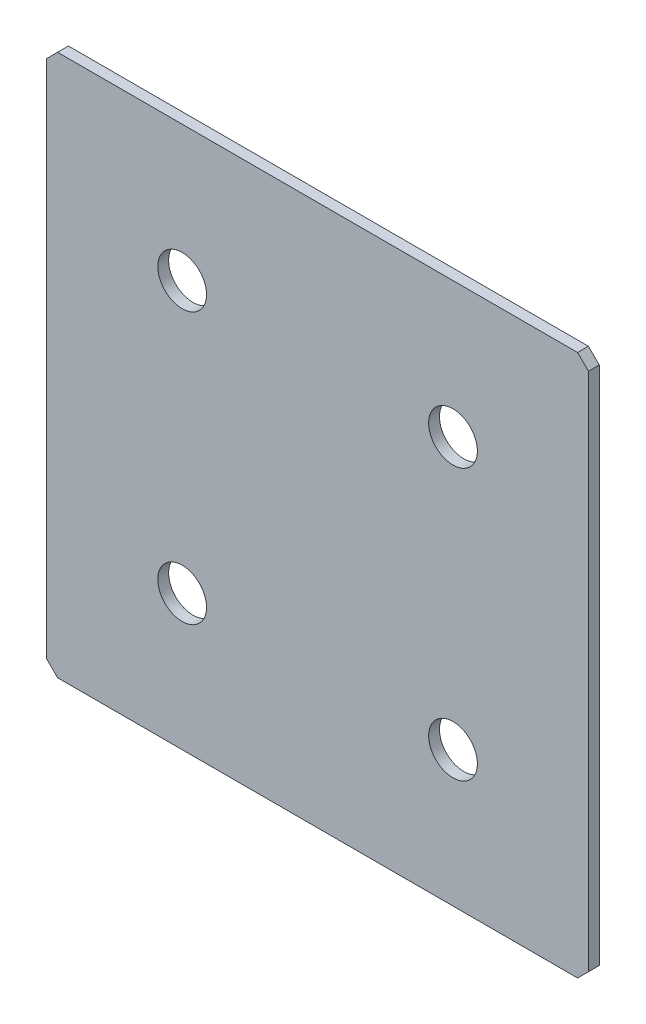
ISO-10303-21;
HEADER;
FILE_DESCRIPTION(('STEP AP214'),'2;1');
FILE_NAME('part.step','',(''),(''),'','','');
FILE_SCHEMA(('AUTOMOTIVE_DESIGN { 1 0 10303 214 1 1 1 1 }'));
ENDSEC;
DATA;
#1=APPLICATION_CONTEXT('core data for automotive mechanical design processes');
#2=APPLICATION_PROTOCOL_DEFINITION('international standard','automotive_design',2000,#1);
#3=PRODUCT_CONTEXT('',#1,'mechanical');
#4=PRODUCT('Part','Part','',(#3));
#5=PRODUCT_RELATED_PRODUCT_CATEGORY('part','',(#4));
#6=PRODUCT_DEFINITION_FORMATION('','',#4);
#7=PRODUCT_DEFINITION_CONTEXT('part definition',#1,'design');
#8=PRODUCT_DEFINITION('design','',#6,#7);
#9=PRODUCT_DEFINITION_SHAPE('','',#8);
#10=(LENGTH_UNIT() NAMED_UNIT(*) SI_UNIT(.MILLI.,.METRE.));
#11=(NAMED_UNIT(*) PLANE_ANGLE_UNIT() SI_UNIT($,.RADIAN.));
#12=(NAMED_UNIT(*) SI_UNIT($,.STERADIAN.) SOLID_ANGLE_UNIT());
#13=UNCERTAINTY_MEASURE_WITH_UNIT(LENGTH_MEASURE(1.E-05),#10,'distance_accuracy_value','');
#14=(GEOMETRIC_REPRESENTATION_CONTEXT(3) GLOBAL_UNCERTAINTY_ASSIGNED_CONTEXT((#13)) GLOBAL_UNIT_ASSIGNED_CONTEXT((#10,
#11,#12)) REPRESENTATION_CONTEXT('',''));
#15=CARTESIAN_POINT('',(0.,0.,0.));
#16=DIRECTION('',(0.,0.,1.));
#17=DIRECTION('',(1.,0.,0.));
#18=AXIS2_PLACEMENT_3D('',#15,#16,#17);
#19=CARTESIAN_POINT('',(50.,-50.,2.));
#20=DIRECTION('',(-1.,0.,0.));
#21=DIRECTION('',(0.,0.,1.));
#22=AXIS2_PLACEMENT_3D('',#19,#20,#21);
#23=PLANE('',#22);
#24=DIRECTION('',(0.,1.,0.));
#25=VECTOR('',#24,1.);
#26=CARTESIAN_POINT('',(50.,-50.,2.));
#27=LINE('',#26,#25);
#28=CARTESIAN_POINT('',(50.,-48.,2.));
#29=VERTEX_POINT('',#28);
#30=CARTESIAN_POINT('',(50.,48.,2.));
#31=VERTEX_POINT('',#30);
#32=EDGE_CURVE('E128',#29,#31,#27,.T.);
#33=ORIENTED_EDGE('',*,*,#32,.F.);
#34=DIRECTION('',(0.,0.,-1.));
#35=VECTOR('',#34,1.);
#36=CARTESIAN_POINT('',(50.,-48.,2.));
#37=LINE('',#36,#35);
#38=CARTESIAN_POINT('',(50.,-48.,0.));
#39=VERTEX_POINT('',#38);
#40=EDGE_CURVE('E154',#29,#39,#37,.T.);
#41=ORIENTED_EDGE('',*,*,#40,.T.);
#42=DIRECTION('',(0.,1.,0.));
#43=VECTOR('',#42,1.);
#44=CARTESIAN_POINT('',(50.,-50.,0.));
#45=LINE('',#44,#43);
#46=CARTESIAN_POINT('',(50.,48.,0.));
#47=VERTEX_POINT('',#46);
#48=EDGE_CURVE('E162',#39,#47,#45,.T.);
#49=ORIENTED_EDGE('',*,*,#48,.T.);
#50=DIRECTION('',(0.,0.,1.));
#51=VECTOR('',#50,1.);
#52=CARTESIAN_POINT('',(50.,48.,2.));
#53=LINE('',#52,#51);
#54=EDGE_CURVE('E152',#47,#31,#53,.T.);
#55=ORIENTED_EDGE('',*,*,#54,.T.);
#56=EDGE_LOOP('',(#33,#41,#49,#55));
#57=FACE_BOUND('',#56,.T.);
#58=ADVANCED_FACE('F37',(#57),#23,.F.);
#59=CARTESIAN_POINT('',(-50.,50.,2.));
#60=DIRECTION('',(0.,-1.,0.));
#61=DIRECTION('',(0.,0.,-1.));
#62=AXIS2_PLACEMENT_3D('',#59,#60,#61);
#63=PLANE('',#62);
#64=DIRECTION('',(-1.,0.,0.));
#65=VECTOR('',#64,1.);
#66=CARTESIAN_POINT('',(-50.,50.,0.));
#67=LINE('',#66,#65);
#68=CARTESIAN_POINT('',(48.,50.,0.));
#69=VERTEX_POINT('',#68);
#70=CARTESIAN_POINT('',(-48.,50.,0.));
#71=VERTEX_POINT('',#70);
#72=EDGE_CURVE('E133',#69,#71,#67,.T.);
#73=ORIENTED_EDGE('',*,*,#72,.T.);
#74=DIRECTION('',(0.,0.,1.));
#75=VECTOR('',#74,1.);
#76=CARTESIAN_POINT('',(-48.,50.,2.));
#77=LINE('',#76,#75);
#78=CARTESIAN_POINT('',(-48.,50.,2.));
#79=VERTEX_POINT('',#78);
#80=EDGE_CURVE('E11',#71,#79,#77,.T.);
#81=ORIENTED_EDGE('',*,*,#80,.T.);
#82=DIRECTION('',(-1.,0.,0.));
#83=VECTOR('',#82,1.);
#84=CARTESIAN_POINT('',(-50.,50.,2.));
#85=LINE('',#84,#83);
#86=CARTESIAN_POINT('',(48.,50.,2.));
#87=VERTEX_POINT('',#86);
#88=EDGE_CURVE('E131',#87,#79,#85,.T.);
#89=ORIENTED_EDGE('',*,*,#88,.F.);
#90=DIRECTION('',(0.,0.,-1.));
#91=VECTOR('',#90,1.);
#92=CARTESIAN_POINT('',(48.,50.,2.));
#93=LINE('',#92,#91);
#94=EDGE_CURVE('E45',#87,#69,#93,.T.);
#95=ORIENTED_EDGE('',*,*,#94,.T.);
#96=EDGE_LOOP('',(#73,#81,#89,#95));
#97=FACE_BOUND('',#96,.T.);
#98=ADVANCED_FACE('F159',(#97),#63,.F.);
#99=CARTESIAN_POINT('',(-50.,-50.,2.));
#100=DIRECTION('',(1.,0.,0.));
#101=DIRECTION('',(0.,0.,-1.));
#102=AXIS2_PLACEMENT_3D('',#99,#100,#101);
#103=PLANE('',#102);
#104=DIRECTION('',(0.,-1.,0.));
#105=VECTOR('',#104,1.);
#106=CARTESIAN_POINT('',(-50.,-50.,0.));
#107=LINE('',#106,#105);
#108=CARTESIAN_POINT('',(-50.,48.,0.));
#109=VERTEX_POINT('',#108);
#110=CARTESIAN_POINT('',(-50.,-48.,0.));
#111=VERTEX_POINT('',#110);
#112=EDGE_CURVE('E129',#109,#111,#107,.T.);
#113=ORIENTED_EDGE('',*,*,#112,.T.);
#114=DIRECTION('',(0.,0.,1.));
#115=VECTOR('',#114,1.);
#116=CARTESIAN_POINT('',(-50.,-48.,2.));
#117=LINE('',#116,#115);
#118=CARTESIAN_POINT('',(-50.,-48.,2.));
#119=VERTEX_POINT('',#118);
#120=EDGE_CURVE('E107',#111,#119,#117,.T.);
#121=ORIENTED_EDGE('',*,*,#120,.T.);
#122=DIRECTION('',(0.,-1.,0.));
#123=VECTOR('',#122,1.);
#124=CARTESIAN_POINT('',(-50.,-50.,2.));
#125=LINE('',#124,#123);
#126=CARTESIAN_POINT('',(-50.,48.,2.));
#127=VERTEX_POINT('',#126);
#128=EDGE_CURVE('E167',#127,#119,#125,.T.);
#129=ORIENTED_EDGE('',*,*,#128,.F.);
#130=DIRECTION('',(0.,0.,-1.));
#131=VECTOR('',#130,1.);
#132=CARTESIAN_POINT('',(-50.,48.,2.));
#133=LINE('',#132,#131);
#134=EDGE_CURVE('E112',#127,#109,#133,.T.);
#135=ORIENTED_EDGE('',*,*,#134,.T.);
#136=EDGE_LOOP('',(#113,#121,#129,#135));
#137=FACE_BOUND('',#136,.T.);
#138=ADVANCED_FACE('F210',(#137),#103,.F.);
#139=CARTESIAN_POINT('',(-50.,-50.,2.));
#140=DIRECTION('',(0.,1.,0.));
#141=DIRECTION('',(0.,0.,1.));
#142=AXIS2_PLACEMENT_3D('',#139,#140,#141);
#143=PLANE('',#142);
#144=DIRECTION('',(1.,0.,0.));
#145=VECTOR('',#144,1.);
#146=CARTESIAN_POINT('',(-50.,-50.,2.));
#147=LINE('',#146,#145);
#148=CARTESIAN_POINT('',(-48.,-50.,2.));
#149=VERTEX_POINT('',#148);
#150=CARTESIAN_POINT('',(48.,-50.,2.));
#151=VERTEX_POINT('',#150);
#152=EDGE_CURVE('E122',#149,#151,#147,.T.);
#153=ORIENTED_EDGE('',*,*,#152,.F.);
#154=DIRECTION('',(0.,0.,-1.));
#155=VECTOR('',#154,1.);
#156=CARTESIAN_POINT('',(-48.,-50.,2.));
#157=LINE('',#156,#155);
#158=CARTESIAN_POINT('',(-48.,-50.,0.));
#159=VERTEX_POINT('',#158);
#160=EDGE_CURVE('E106',#149,#159,#157,.T.);
#161=ORIENTED_EDGE('',*,*,#160,.T.);
#162=DIRECTION('',(1.,0.,0.));
#163=VECTOR('',#162,1.);
#164=CARTESIAN_POINT('',(-50.,-50.,0.));
#165=LINE('',#164,#163);
#166=CARTESIAN_POINT('',(48.,-50.,0.));
#167=VERTEX_POINT('',#166);
#168=EDGE_CURVE('E119',#159,#167,#165,.T.);
#169=ORIENTED_EDGE('',*,*,#168,.T.);
#170=DIRECTION('',(0.,0.,1.));
#171=VECTOR('',#170,1.);
#172=CARTESIAN_POINT('',(48.,-50.,2.));
#173=LINE('',#172,#171);
#174=EDGE_CURVE('E124',#167,#151,#173,.T.);
#175=ORIENTED_EDGE('',*,*,#174,.T.);
#176=EDGE_LOOP('',(#153,#161,#169,#175));
#177=FACE_BOUND('',#176,.T.);
#178=ADVANCED_FACE('F118',(#177),#143,.F.);
#179=CARTESIAN_POINT('',(0.,0.,2.));
#180=DIRECTION('',(0.,0.,-1.));
#181=DIRECTION('',(-1.,0.,0.));
#182=AXIS2_PLACEMENT_3D('',#179,#180,#181);
#183=PLANE('',#182);
#184=CARTESIAN_POINT('',(-25.,25.,2.));
#185=DIRECTION('',(0.,0.,1.));
#186=DIRECTION('',(1.,0.,0.));
#187=AXIS2_PLACEMENT_3D('',#184,#185,#186);
#188=CIRCLE('',#187,4.5);
#189=CARTESIAN_POINT('',(-20.5,25.,2.));
#190=VERTEX_POINT('',#189);
#191=EDGE_CURVE('E191',#190,#190,#188,.T.);
#192=ORIENTED_EDGE('',*,*,#191,.F.);
#193=EDGE_LOOP('',(#192));
#194=FACE_BOUND('',#193,.T.);
#195=CARTESIAN_POINT('',(25.,25.,2.));
#196=DIRECTION('',(0.,0.,1.));
#197=DIRECTION('',(1.,0.,0.));
#198=AXIS2_PLACEMENT_3D('',#195,#196,#197);
#199=CIRCLE('',#198,4.5);
#200=CARTESIAN_POINT('',(29.5,25.,2.));
#201=VERTEX_POINT('',#200);
#202=EDGE_CURVE('E185',#201,#201,#199,.T.);
#203=ORIENTED_EDGE('',*,*,#202,.F.);
#204=EDGE_LOOP('',(#203));
#205=FACE_BOUND('',#204,.T.);
#206=CARTESIAN_POINT('',(-25.,-25.,2.));
#207=DIRECTION('',(0.,0.,1.));
#208=DIRECTION('',(1.,0.,0.));
#209=AXIS2_PLACEMENT_3D('',#206,#207,#208);
#210=CIRCLE('',#209,4.5);
#211=CARTESIAN_POINT('',(-20.5,-25.,2.));
#212=VERTEX_POINT('',#211);
#213=EDGE_CURVE('E179',#212,#212,#210,.T.);
#214=ORIENTED_EDGE('',*,*,#213,.F.);
#215=EDGE_LOOP('',(#214));
#216=FACE_BOUND('',#215,.T.);
#217=CARTESIAN_POINT('',(25.,-25.,2.));
#218=DIRECTION('',(0.,0.,1.));
#219=DIRECTION('',(1.,0.,0.));
#220=AXIS2_PLACEMENT_3D('',#217,#218,#219);
#221=CIRCLE('',#220,4.5);
#222=CARTESIAN_POINT('',(29.5,-25.,2.));
#223=VERTEX_POINT('',#222);
#224=EDGE_CURVE('E173',#223,#223,#221,.T.);
#225=ORIENTED_EDGE('',*,*,#224,.F.);
#226=EDGE_LOOP('',(#225));
#227=FACE_BOUND('',#226,.T.);
#228=ORIENTED_EDGE('',*,*,#128,.T.);
#229=DIRECTION('',(-0.707106781186545,0.70710678118655,0.));
#230=VECTOR('',#229,1.);
#231=CARTESIAN_POINT('',(-48.,-50.,2.));
#232=LINE('',#231,#230);
#233=EDGE_CURVE('E150',#119,#149,#232,.F.);
#234=ORIENTED_EDGE('',*,*,#233,.T.);
#235=ORIENTED_EDGE('',*,*,#152,.T.);
#236=DIRECTION('',(-0.70710678118655,-0.707106781186545,0.));
#237=VECTOR('',#236,1.);
#238=CARTESIAN_POINT('',(50.,-48.,2.));
#239=LINE('',#238,#237);
#240=EDGE_CURVE('E148',#151,#29,#239,.F.);
#241=ORIENTED_EDGE('',*,*,#240,.T.);
#242=ORIENTED_EDGE('',*,*,#32,.T.);
#243=DIRECTION('',(0.707106781186545,-0.70710678118655,0.));
#244=VECTOR('',#243,1.);
#245=CARTESIAN_POINT('',(48.,50.,2.));
#246=LINE('',#245,#244);
#247=EDGE_CURVE('E57',#31,#87,#246,.F.);
#248=ORIENTED_EDGE('',*,*,#247,.T.);
#249=ORIENTED_EDGE('',*,*,#88,.T.);
#250=DIRECTION('',(0.70710678118655,0.707106781186545,0.));
#251=VECTOR('',#250,1.);
#252=CARTESIAN_POINT('',(-50.,48.,2.));
#253=LINE('',#252,#251);
#254=EDGE_CURVE('E146',#79,#127,#253,.F.);
#255=ORIENTED_EDGE('',*,*,#254,.T.);
#256=EDGE_LOOP('',(#228,#234,#235,#241,#242,#248,#249,#255));
#257=FACE_BOUND('',#256,.T.);
#258=ADVANCED_FACE('F197',(#194,#205,#216,#227,#257),#183,.F.);
#259=CARTESIAN_POINT('',(0.,0.,0.));
#260=DIRECTION('',(0.,0.,-1.));
#261=DIRECTION('',(-1.,0.,0.));
#262=AXIS2_PLACEMENT_3D('',#259,#260,#261);
#263=PLANE('',#262);
#264=CARTESIAN_POINT('',(-25.,25.,0.));
#265=DIRECTION('',(0.,0.,1.));
#266=DIRECTION('',(1.,0.,0.));
#267=AXIS2_PLACEMENT_3D('',#264,#265,#266);
#268=CIRCLE('',#267,4.5);
#269=CARTESIAN_POINT('',(-20.5,25.,0.));
#270=VERTEX_POINT('',#269);
#271=EDGE_CURVE('E188',#270,#270,#268,.T.);
#272=ORIENTED_EDGE('',*,*,#271,.T.);
#273=EDGE_LOOP('',(#272));
#274=FACE_BOUND('',#273,.T.);
#275=CARTESIAN_POINT('',(25.,25.,0.));
#276=DIRECTION('',(0.,0.,1.));
#277=DIRECTION('',(1.,0.,0.));
#278=AXIS2_PLACEMENT_3D('',#275,#276,#277);
#279=CIRCLE('',#278,4.5);
#280=CARTESIAN_POINT('',(29.5,25.,0.));
#281=VERTEX_POINT('',#280);
#282=EDGE_CURVE('E182',#281,#281,#279,.T.);
#283=ORIENTED_EDGE('',*,*,#282,.T.);
#284=EDGE_LOOP('',(#283));
#285=FACE_BOUND('',#284,.T.);
#286=CARTESIAN_POINT('',(-25.,-25.,0.));
#287=DIRECTION('',(0.,0.,1.));
#288=DIRECTION('',(1.,0.,0.));
#289=AXIS2_PLACEMENT_3D('',#286,#287,#288);
#290=CIRCLE('',#289,4.5);
#291=CARTESIAN_POINT('',(-20.5,-25.,0.));
#292=VERTEX_POINT('',#291);
#293=EDGE_CURVE('E176',#292,#292,#290,.T.);
#294=ORIENTED_EDGE('',*,*,#293,.T.);
#295=EDGE_LOOP('',(#294));
#296=FACE_BOUND('',#295,.T.);
#297=CARTESIAN_POINT('',(25.,-25.,0.));
#298=DIRECTION('',(0.,0.,1.));
#299=DIRECTION('',(1.,0.,0.));
#300=AXIS2_PLACEMENT_3D('',#297,#298,#299);
#301=CIRCLE('',#300,4.5);
#302=CARTESIAN_POINT('',(29.5,-25.,0.));
#303=VERTEX_POINT('',#302);
#304=EDGE_CURVE('E163',#303,#303,#301,.T.);
#305=ORIENTED_EDGE('',*,*,#304,.T.);
#306=EDGE_LOOP('',(#305));
#307=FACE_BOUND('',#306,.T.);
#308=ORIENTED_EDGE('',*,*,#168,.F.);
#309=DIRECTION('',(0.707106781186545,-0.70710678118655,0.));
#310=VECTOR('',#309,1.);
#311=CARTESIAN_POINT('',(-49.0000000000002,-48.9999999999998,0.));
#312=LINE('',#311,#310);
#313=EDGE_CURVE('E102',#159,#111,#312,.F.);
#314=ORIENTED_EDGE('',*,*,#313,.T.);
#315=ORIENTED_EDGE('',*,*,#112,.F.);
#316=DIRECTION('',(-0.70710678118655,-0.707106781186545,0.));
#317=VECTOR('',#316,1.);
#318=CARTESIAN_POINT('',(-48.9999999999998,49.0000000000002,0.));
#319=LINE('',#318,#317);
#320=EDGE_CURVE('E139',#109,#71,#319,.F.);
#321=ORIENTED_EDGE('',*,*,#320,.T.);
#322=ORIENTED_EDGE('',*,*,#72,.F.);
#323=DIRECTION('',(-0.707106781186545,0.70710678118655,0.));
#324=VECTOR('',#323,1.);
#325=CARTESIAN_POINT('',(49.0000000000002,48.9999999999998,0.));
#326=LINE('',#325,#324);
#327=EDGE_CURVE('E123',#69,#47,#326,.F.);
#328=ORIENTED_EDGE('',*,*,#327,.T.);
#329=ORIENTED_EDGE('',*,*,#48,.F.);
#330=DIRECTION('',(0.70710678118655,0.707106781186545,0.));
#331=VECTOR('',#330,1.);
#332=CARTESIAN_POINT('',(48.9999999999998,-49.0000000000002,0.));
#333=LINE('',#332,#331);
#334=EDGE_CURVE('E113',#39,#167,#333,.F.);
#335=ORIENTED_EDGE('',*,*,#334,.T.);
#336=EDGE_LOOP('',(#308,#314,#315,#321,#322,#328,#329,#335));
#337=FACE_BOUND('',#336,.T.);
#338=ADVANCED_FACE('F126',(#274,#285,#296,#307,#337),#263,.T.);
#339=CARTESIAN_POINT('',(-48.,-50.,2.));
#340=DIRECTION('',(0.70710678118655,0.707106781186545,0.));
#341=DIRECTION('',(0.,0.,-1.));
#342=AXIS2_PLACEMENT_3D('',#339,#340,#341);
#343=PLANE('',#342);
#344=ORIENTED_EDGE('',*,*,#233,.F.);
#345=ORIENTED_EDGE('',*,*,#120,.F.);
#346=ORIENTED_EDGE('',*,*,#313,.F.);
#347=ORIENTED_EDGE('',*,*,#160,.F.);
#348=EDGE_LOOP('',(#344,#345,#346,#347));
#349=FACE_BOUND('',#348,.T.);
#350=ADVANCED_FACE('F105',(#349),#343,.F.);
#351=CARTESIAN_POINT('',(50.,-48.,2.));
#352=DIRECTION('',(-0.707106781186545,0.70710678118655,0.));
#353=DIRECTION('',(0.,0.,-1.));
#354=AXIS2_PLACEMENT_3D('',#351,#352,#353);
#355=PLANE('',#354);
#356=ORIENTED_EDGE('',*,*,#240,.F.);
#357=ORIENTED_EDGE('',*,*,#174,.F.);
#358=ORIENTED_EDGE('',*,*,#334,.F.);
#359=ORIENTED_EDGE('',*,*,#40,.F.);
#360=EDGE_LOOP('',(#356,#357,#358,#359));
#361=FACE_BOUND('',#360,.T.);
#362=ADVANCED_FACE('F214',(#361),#355,.F.);
#363=CARTESIAN_POINT('',(-50.,48.,2.));
#364=DIRECTION('',(0.707106781186545,-0.70710678118655,0.));
#365=DIRECTION('',(0.,0.,-1.));
#366=AXIS2_PLACEMENT_3D('',#363,#364,#365);
#367=PLANE('',#366);
#368=ORIENTED_EDGE('',*,*,#254,.F.);
#369=ORIENTED_EDGE('',*,*,#80,.F.);
#370=ORIENTED_EDGE('',*,*,#320,.F.);
#371=ORIENTED_EDGE('',*,*,#134,.F.);
#372=EDGE_LOOP('',(#368,#369,#370,#371));
#373=FACE_BOUND('',#372,.T.);
#374=ADVANCED_FACE('F212',(#373),#367,.F.);
#375=CARTESIAN_POINT('',(48.,50.,2.));
#376=DIRECTION('',(-0.70710678118655,-0.707106781186545,0.));
#377=DIRECTION('',(0.,0.,-1.));
#378=AXIS2_PLACEMENT_3D('',#375,#376,#377);
#379=PLANE('',#378);
#380=ORIENTED_EDGE('',*,*,#247,.F.);
#381=ORIENTED_EDGE('',*,*,#54,.F.);
#382=ORIENTED_EDGE('',*,*,#327,.F.);
#383=ORIENTED_EDGE('',*,*,#94,.F.);
#384=EDGE_LOOP('',(#380,#381,#382,#383));
#385=FACE_BOUND('',#384,.T.);
#386=ADVANCED_FACE('F39',(#385),#379,.F.);
#387=CARTESIAN_POINT('',(25.,-25.,2.));
#388=DIRECTION('',(0.,0.,1.));
#389=DIRECTION('',(1.,0.,0.));
#390=AXIS2_PLACEMENT_3D('',#387,#388,#389);
#391=CYLINDRICAL_SURFACE('',#390,4.5);
#392=ORIENTED_EDGE('',*,*,#304,.F.);
#393=EDGE_LOOP('',(#392));
#394=FACE_BOUND('',#393,.T.);
#395=ORIENTED_EDGE('',*,*,#224,.T.);
#396=EDGE_LOOP('',(#395));
#397=FACE_BOUND('',#396,.T.);
#398=ADVANCED_FACE('F219',(#394,#397),#391,.F.);
#399=CARTESIAN_POINT('',(-25.,-25.,2.));
#400=DIRECTION('',(0.,0.,1.));
#401=DIRECTION('',(1.,0.,0.));
#402=AXIS2_PLACEMENT_3D('',#399,#400,#401);
#403=CYLINDRICAL_SURFACE('',#402,4.5);
#404=ORIENTED_EDGE('',*,*,#293,.F.);
#405=EDGE_LOOP('',(#404));
#406=FACE_BOUND('',#405,.T.);
#407=ORIENTED_EDGE('',*,*,#213,.T.);
#408=EDGE_LOOP('',(#407));
#409=FACE_BOUND('',#408,.T.);
#410=ADVANCED_FACE('F274',(#406,#409),#403,.F.);
#411=CARTESIAN_POINT('',(25.,25.,2.));
#412=DIRECTION('',(0.,0.,1.));
#413=DIRECTION('',(1.,0.,0.));
#414=AXIS2_PLACEMENT_3D('',#411,#412,#413);
#415=CYLINDRICAL_SURFACE('',#414,4.5);
#416=ORIENTED_EDGE('',*,*,#282,.F.);
#417=EDGE_LOOP('',(#416));
#418=FACE_BOUND('',#417,.T.);
#419=ORIENTED_EDGE('',*,*,#202,.T.);
#420=EDGE_LOOP('',(#419));
#421=FACE_BOUND('',#420,.T.);
#422=ADVANCED_FACE('F283',(#418,#421),#415,.F.);
#423=CARTESIAN_POINT('',(-25.,25.,2.));
#424=DIRECTION('',(0.,0.,1.));
#425=DIRECTION('',(1.,0.,0.));
#426=AXIS2_PLACEMENT_3D('',#423,#424,#425);
#427=CYLINDRICAL_SURFACE('',#426,4.5);
#428=ORIENTED_EDGE('',*,*,#271,.F.);
#429=EDGE_LOOP('',(#428));
#430=FACE_BOUND('',#429,.T.);
#431=ORIENTED_EDGE('',*,*,#191,.T.);
#432=EDGE_LOOP('',(#431));
#433=FACE_BOUND('',#432,.T.);
#434=ADVANCED_FACE('F195',(#430,#433),#427,.F.);
#435=CLOSED_SHELL('',(#58,#98,#138,#178,#258,#338,#350,#362,#374,#386,#398,#410,#422,#434));
#436=MANIFOLD_SOLID_BREP('B2',#435);
#437=ADVANCED_BREP_SHAPE_REPRESENTATION('',(#18,#436),#14);
#438=SHAPE_DEFINITION_REPRESENTATION(#9,#437);
ENDSEC;
END-ISO-10303-21;
